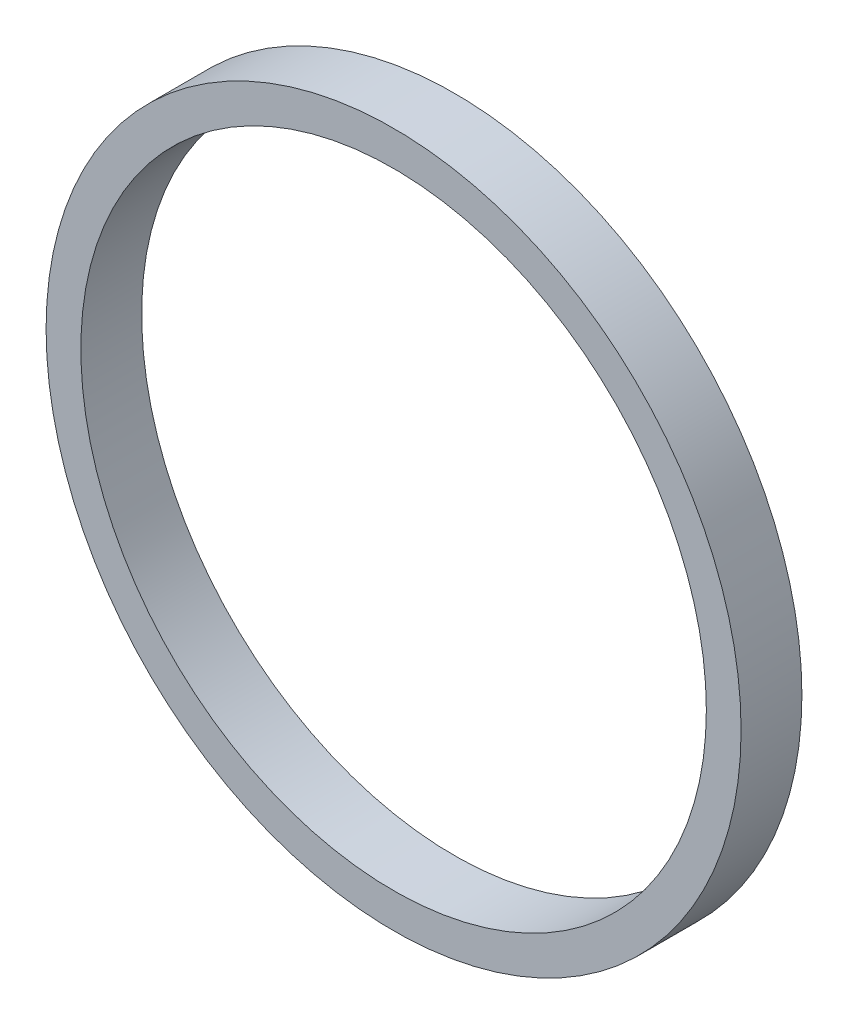
ISO-10303-21;
HEADER;
FILE_DESCRIPTION(('STEP AP214'),'2;1');
FILE_NAME('part.step','',(''),(''),'','','');
FILE_SCHEMA(('AUTOMOTIVE_DESIGN { 1 0 10303 214 1 1 1 1 }'));
ENDSEC;
DATA;
#1=APPLICATION_CONTEXT('core data for automotive mechanical design processes');
#2=APPLICATION_PROTOCOL_DEFINITION('international standard','automotive_design',2000,#1);
#3=PRODUCT_CONTEXT('',#1,'mechanical');
#4=PRODUCT('Part','Part','',(#3));
#5=PRODUCT_RELATED_PRODUCT_CATEGORY('part','',(#4));
#6=PRODUCT_DEFINITION_FORMATION('','',#4);
#7=PRODUCT_DEFINITION_CONTEXT('part definition',#1,'design');
#8=PRODUCT_DEFINITION('design','',#6,#7);
#9=PRODUCT_DEFINITION_SHAPE('','',#8);
#10=(LENGTH_UNIT() NAMED_UNIT(*) SI_UNIT(.MILLI.,.METRE.));
#11=(NAMED_UNIT(*) PLANE_ANGLE_UNIT() SI_UNIT($,.RADIAN.));
#12=(NAMED_UNIT(*) SI_UNIT($,.STERADIAN.) SOLID_ANGLE_UNIT());
#13=UNCERTAINTY_MEASURE_WITH_UNIT(LENGTH_MEASURE(1.E-05),#10,'distance_accuracy_value','');
#14=(GEOMETRIC_REPRESENTATION_CONTEXT(3) GLOBAL_UNCERTAINTY_ASSIGNED_CONTEXT((#13)) GLOBAL_UNIT_ASSIGNED_CONTEXT((#10,
#11,#12)) REPRESENTATION_CONTEXT('',''));
#15=CARTESIAN_POINT('',(0.,0.,0.));
#16=DIRECTION('',(0.,0.,1.));
#17=DIRECTION('',(1.,0.,0.));
#18=AXIS2_PLACEMENT_3D('',#15,#16,#17);
#19=CARTESIAN_POINT('',(0.,0.,7.));
#20=DIRECTION('',(0.,0.,1.));
#21=DIRECTION('',(1.,0.,0.));
#22=AXIS2_PLACEMENT_3D('',#19,#20,#21);
#23=PLANE('',#22);
#24=CARTESIAN_POINT('',(0.,0.,7.));
#25=DIRECTION('',(0.,0.,1.));
#26=DIRECTION('',(1.,0.,0.));
#27=AXIS2_PLACEMENT_3D('',#24,#25,#26);
#28=CIRCLE('',#27,40.);
#29=CARTESIAN_POINT('',(40.,0.,7.));
#30=VERTEX_POINT('',#29);
#31=EDGE_CURVE('E10',#30,#30,#28,.T.);
#32=ORIENTED_EDGE('',*,*,#31,.T.);
#33=EDGE_LOOP('',(#32));
#34=FACE_BOUND('',#33,.T.);
#35=CARTESIAN_POINT('',(0.,0.,7.));
#36=DIRECTION('',(0.,0.,1.));
#37=DIRECTION('',(1.,0.,0.));
#38=AXIS2_PLACEMENT_3D('',#35,#36,#37);
#39=CIRCLE('',#38,36.);
#40=CARTESIAN_POINT('',(36.,0.,7.));
#41=VERTEX_POINT('',#40);
#42=EDGE_CURVE('E50',#41,#41,#39,.T.);
#43=ORIENTED_EDGE('',*,*,#42,.F.);
#44=EDGE_LOOP('',(#43));
#45=FACE_BOUND('',#44,.T.);
#46=ADVANCED_FACE('F37',(#34,#45),#23,.T.);
#47=CARTESIAN_POINT('',(0.,0.,0.));
#48=DIRECTION('',(0.,0.,1.));
#49=DIRECTION('',(1.,0.,0.));
#50=AXIS2_PLACEMENT_3D('',#47,#48,#49);
#51=PLANE('',#50);
#52=CARTESIAN_POINT('',(0.,0.,0.));
#53=DIRECTION('',(0.,0.,1.));
#54=DIRECTION('',(1.,0.,0.));
#55=AXIS2_PLACEMENT_3D('',#52,#53,#54);
#56=CIRCLE('',#55,40.);
#57=CARTESIAN_POINT('',(40.,0.,0.));
#58=VERTEX_POINT('',#57);
#59=EDGE_CURVE('E41',#58,#58,#56,.T.);
#60=ORIENTED_EDGE('',*,*,#59,.F.);
#61=EDGE_LOOP('',(#60));
#62=FACE_BOUND('',#61,.T.);
#63=CARTESIAN_POINT('',(0.,0.,0.));
#64=DIRECTION('',(0.,0.,1.));
#65=DIRECTION('',(1.,0.,0.));
#66=AXIS2_PLACEMENT_3D('',#63,#64,#65);
#67=CIRCLE('',#66,36.);
#68=CARTESIAN_POINT('',(36.,0.,0.));
#69=VERTEX_POINT('',#68);
#70=EDGE_CURVE('E52',#69,#69,#67,.T.);
#71=ORIENTED_EDGE('',*,*,#70,.T.);
#72=EDGE_LOOP('',(#71));
#73=FACE_BOUND('',#72,.T.);
#74=ADVANCED_FACE('F64',(#62,#73),#51,.F.);
#75=CARTESIAN_POINT('',(0.,0.,7.));
#76=DIRECTION('',(0.,0.,-1.));
#77=DIRECTION('',(-1.,0.,0.));
#78=AXIS2_PLACEMENT_3D('',#75,#76,#77);
#79=CYLINDRICAL_SURFACE('',#78,40.);
#80=ORIENTED_EDGE('',*,*,#31,.F.);
#81=EDGE_LOOP('',(#80));
#82=FACE_BOUND('',#81,.T.);
#83=ORIENTED_EDGE('',*,*,#59,.T.);
#84=EDGE_LOOP('',(#83));
#85=FACE_BOUND('',#84,.T.);
#86=ADVANCED_FACE('F39',(#82,#85),#79,.T.);
#87=CARTESIAN_POINT('',(0.,0.,7.));
#88=DIRECTION('',(0.,0.,-1.));
#89=DIRECTION('',(-1.,0.,0.));
#90=AXIS2_PLACEMENT_3D('',#87,#88,#89);
#91=CYLINDRICAL_SURFACE('',#90,36.);
#92=ORIENTED_EDGE('',*,*,#42,.T.);
#93=EDGE_LOOP('',(#92));
#94=FACE_BOUND('',#93,.T.);
#95=ORIENTED_EDGE('',*,*,#70,.F.);
#96=EDGE_LOOP('',(#95));
#97=FACE_BOUND('',#96,.T.);
#98=ADVANCED_FACE('F60',(#94,#97),#91,.F.);
#99=CLOSED_SHELL('',(#46,#74,#86,#98));
#100=MANIFOLD_SOLID_BREP('B2',#99);
#101=ADVANCED_BREP_SHAPE_REPRESENTATION('',(#18,#100),#14);
#102=SHAPE_DEFINITION_REPRESENTATION(#9,#101);
ENDSEC;
END-ISO-10303-21;
